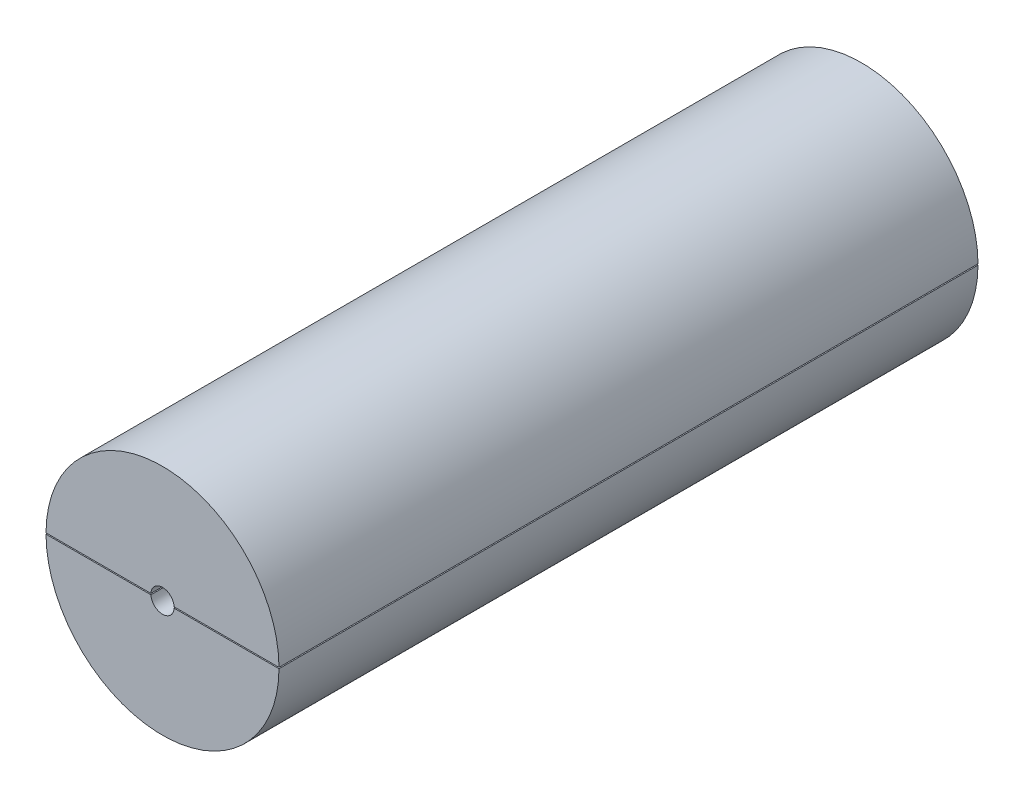
ISO-10303-21;
HEADER;
FILE_DESCRIPTION(('STEP AP214'),'2;1');
FILE_NAME('part.step','',(''),(''),'','','');
FILE_SCHEMA(('AUTOMOTIVE_DESIGN { 1 0 10303 214 1 1 1 1 }'));
ENDSEC;
DATA;
#1=APPLICATION_CONTEXT('core data for automotive mechanical design processes');
#2=APPLICATION_PROTOCOL_DEFINITION('international standard','automotive_design',2000,#1);
#3=PRODUCT_CONTEXT('',#1,'mechanical');
#4=PRODUCT('Part','Part','',(#3));
#5=PRODUCT_RELATED_PRODUCT_CATEGORY('part','',(#4));
#6=PRODUCT_DEFINITION_FORMATION('','',#4);
#7=PRODUCT_DEFINITION_CONTEXT('part definition',#1,'design');
#8=PRODUCT_DEFINITION('design','',#6,#7);
#9=PRODUCT_DEFINITION_SHAPE('','',#8);
#10=(LENGTH_UNIT() NAMED_UNIT(*) SI_UNIT(.MILLI.,.METRE.));
#11=(NAMED_UNIT(*) PLANE_ANGLE_UNIT() SI_UNIT($,.RADIAN.));
#12=(NAMED_UNIT(*) SI_UNIT($,.STERADIAN.) SOLID_ANGLE_UNIT());
#13=UNCERTAINTY_MEASURE_WITH_UNIT(LENGTH_MEASURE(1.E-05),#10,'distance_accuracy_value','');
#14=(GEOMETRIC_REPRESENTATION_CONTEXT(3) GLOBAL_UNCERTAINTY_ASSIGNED_CONTEXT((#13)) GLOBAL_UNIT_ASSIGNED_CONTEXT((#10,
#11,#12)) REPRESENTATION_CONTEXT('',''));
#15=CARTESIAN_POINT('',(0.,0.,0.));
#16=DIRECTION('',(0.,0.,1.));
#17=DIRECTION('',(1.,0.,0.));
#18=AXIS2_PLACEMENT_3D('',#15,#16,#17);
#19=CARTESIAN_POINT('',(0.,0.,-95.));
#20=DIRECTION('',(0.,0.,1.));
#21=DIRECTION('',(1.,0.,0.));
#22=AXIS2_PLACEMENT_3D('',#19,#20,#21);
#23=CYLINDRICAL_SURFACE('',#22,16.);
#24=CARTESIAN_POINT('',(15.9996874956982,0.100000200000962,-95.0002));
#25=CARTESIAN_POINT('',(15.9996876089245,0.0999613166636497,-94.9933909110656));
#26=CARTESIAN_POINT('',(15.9996833359999,0.100667343260459,-94.9866189886162));
#27=CARTESIAN_POINT('',(15.9996664742526,0.103322093203284,-94.9734331409172));
#28=CARTESIAN_POINT('',(15.9996540231289,0.105250221129936,-94.9670151631769));
#29=CARTESIAN_POINT('',(15.9996167256408,0.110786102343066,-94.9528734828148));
#30=CARTESIAN_POINT('',(15.9995894090706,0.11471028723087,-94.9452773244607));
#31=CARTESIAN_POINT('',(15.9995223957738,0.12370890358297,-94.9307562380063));
#32=CARTESIAN_POINT('',(15.999482612251,0.128791329006479,-94.9238364763829));
#33=CARTESIAN_POINT('',(15.9993504725112,0.144525673591268,-94.904808843254));
#34=CARTESIAN_POINT('',(15.9992426946636,0.1561363522168,-94.8935076802659));
#35=CARTESIAN_POINT('',(15.998984408498,0.180705288968248,-94.8725336488729));
#36=CARTESIAN_POINT('',(15.9988338081395,0.193666411233282,-94.8628643600561));
#37=CARTESIAN_POINT('',(15.9980346259693,0.255298625632148,-94.8205617079184));
#38=CARTESIAN_POINT('',(15.9971179787717,0.308242970572141,-94.7944084734029));
#39=CARTESIAN_POINT('',(15.9946762218346,0.416398657564381,-94.747491478125));
#40=CARTESIAN_POINT('',(15.9931468802502,0.471623319166156,-94.7267668945409));
#41=CARTESIAN_POINT('',(15.9876683633117,0.637564752046911,-94.6698337453855));
#42=CARTESIAN_POINT('',(15.982813728992,0.749883874807342,-94.6382317593188));
#43=CARTESIAN_POINT('',(15.9706204430243,0.975817455917367,-94.5805638647358));
#44=CARTESIAN_POINT('',(15.9632772031576,1.08943392957803,-94.5545083276732));
#45=CARTESIAN_POINT('',(15.946108566696,1.31703651192761,-94.5060300565223));
#46=CARTESIAN_POINT('',(15.9362882944059,1.43102138372045,-94.4835999776359));
#47=CARTESIAN_POINT('',(15.9141618109084,1.65909642172321,-94.441203693864));
#48=CARTESIAN_POINT('',(15.9018574595061,1.77318644596788,-94.421235663577));
#49=CARTESIAN_POINT('',(15.8386705583791,2.30505946467228,-94.3321411780839));
#50=CARTESIAN_POINT('',(15.7722764358871,2.72289413244487,-94.2736362565787));
#51=CARTESIAN_POINT('',(15.6061590460522,3.55355292641803,-94.1673325131355));
#52=CARTESIAN_POINT('',(15.5063990006465,3.9663710003421,-94.1195456028093));
#53=CARTESIAN_POINT('',(15.2738971238386,4.78425016336286,-94.0310629905377));
#54=CARTESIAN_POINT('',(15.1410951067343,5.18929562832988,-93.9903804618779));
#55=CARTESIAN_POINT('',(14.8434558371158,5.98776591234989,-93.9141900760265));
#56=CARTESIAN_POINT('',(14.6786295456577,6.3811946545708,-93.8786804555422));
#57=CARTESIAN_POINT('',(14.3183042194909,7.15312590557042,-93.8118329726691));
#58=CARTESIAN_POINT('',(14.122868793987,7.53165737562533,-93.7804867026022));
#59=CARTESIAN_POINT('',(13.7022902081215,8.27215629418123,-93.721208755686));
#60=CARTESIAN_POINT('',(13.4771448061774,8.63412249007385,-93.6932773367896));
#61=CARTESIAN_POINT('',(12.9987065689512,9.3388932284815,-93.6404131747481));
#62=CARTESIAN_POINT('',(12.7454290565378,9.68170805082223,-93.6154788144401));
#63=CARTESIAN_POINT('',(12.2122318728589,10.3461515685606,-93.568292528328));
#64=CARTESIAN_POINT('',(11.9323117119552,10.667779874409,-93.5460406518395));
#65=CARTESIAN_POINT('',(11.3317763928884,11.3045375699943,-93.5028700138265));
#66=CARTESIAN_POINT('',(11.0097789725468,11.6183742775231,-93.4820884778206));
#67=CARTESIAN_POINT('',(10.3404223446201,12.2179195559933,-93.443091603038));
#68=CARTESIAN_POINT('',(9.99306204875921,12.503626918718,-93.4248763744754));
#69=CARTESIAN_POINT('',(9.27536172801475,13.0449120839114,-93.3908787227275));
#70=CARTESIAN_POINT('',(8.90501607913624,13.300482467832,-93.3750968982585));
#71=CARTESIAN_POINT('',(8.14405853740691,13.7795665483632,-93.3458758669486));
#72=CARTESIAN_POINT('',(7.75344686456849,14.0030805928853,-93.3324366346828));
#73=CARTESIAN_POINT('',(6.95497153645159,14.4163217268977,-93.3078370478819));
#74=CARTESIAN_POINT('',(6.5471183822281,14.6060690255832,-93.2966753296779));
#75=CARTESIAN_POINT('',(5.71684009610057,14.9505769688768,-93.2765684201727));
#76=CARTESIAN_POINT('',(5.29441493339596,15.1053375395289,-93.267623233557));
#77=CARTESIAN_POINT('',(4.43801939847277,15.3787521135395,-93.2519118745392));
#78=CARTESIAN_POINT('',(4.00404957262244,15.4974078223197,-93.2451455992148));
#79=CARTESIAN_POINT('',(3.12763494114479,15.6977693048596,-93.2337649598654));
#80=CARTESIAN_POINT('',(2.68519014406141,15.7794751158678,-93.2291505936709));
#81=CARTESIAN_POINT('',(1.79528754715403,15.9053054539425,-93.2220591578145));
#82=CARTESIAN_POINT('',(1.34783347135442,15.949456235396,-93.2195805950155));
#83=CARTESIAN_POINT('',(0.450790584374749,15.9999561458381,-93.2167464468439));
#84=CARTESIAN_POINT('',(0.00120177397525275,16.0063052886476,-93.2163908606951));
#85=CARTESIAN_POINT('',(-0.896915468850043,15.9811562701698,-93.2178014243669));
#86=CARTESIAN_POINT('',(-1.34544389467319,15.9496578738371,-93.2195675873641));
#87=CARTESIAN_POINT('',(-2.23824728385251,15.8490395450346,-93.2252279223656));
#88=CARTESIAN_POINT('',(-2.68252224753776,15.7799196154753,-93.2291220942052));
#89=CARTESIAN_POINT('',(-3.56356082605615,15.6045741075047,-93.2390515384342));
#90=CARTESIAN_POINT('',(-4.0003260947656,15.4983568118579,-93.2450863328894));
#91=CARTESIAN_POINT('',(-4.86334332701998,15.2495758728171,-93.2593202877308));
#92=CARTESIAN_POINT('',(-5.28959529058503,15.1070122294925,-93.2675194481129));
#93=CARTESIAN_POINT('',(-6.12853978672644,14.7865688767694,-93.2861154409353));
#94=CARTESIAN_POINT('',(-6.54123291639549,14.608690724958,-93.2965121764503));
#95=CARTESIAN_POINT('',(-7.35014986045461,14.2188912851071,-93.3195503530631));
#96=CARTESIAN_POINT('',(-7.74637369200348,14.006970032537,-93.3321917918222));
#97=CARTESIAN_POINT('',(-8.51961263704004,13.5505641232963,-93.3597855869767));
#98=CARTESIAN_POINT('',(-8.89662425848611,13.3060735757599,-93.3747383615063));
#99=CARTESIAN_POINT('',(-9.62869175778507,12.7863135610525,-93.4070393256557));
#100=CARTESIAN_POINT('',(-9.98374751583813,12.5110439259616,-93.4243875283442));
#101=CARTESIAN_POINT('',(-10.6694792407113,11.9316282797633,-93.4616007689872));
#102=CARTESIAN_POINT('',(-11.0001487105794,11.6274746224466,-93.4814664738458));
#103=CARTESIAN_POINT('',(-11.6346591976653,10.9925490503296,-93.5238700275449));
#104=CARTESIAN_POINT('',(-11.9385007879715,10.6617777044161,-93.5464078192812));
#105=CARTESIAN_POINT('',(-12.5175748096972,9.97557596942283,-93.5944067247153));
#106=CARTESIAN_POINT('',(-12.7927717936654,9.62011591383932,-93.6198713803148));
#107=CARTESIAN_POINT('',(-13.3121916675464,8.88747395326126,-93.6740177660672));
#108=CARTESIAN_POINT('',(-13.5564145341072,8.5102920318905,-93.7026994986455));
#109=CARTESIAN_POINT('',(-14.0119527470274,7.73732704436563,-93.7637165519852));
#110=CARTESIAN_POINT('',(-14.2232996532385,7.34156229834177,-93.7960483167205));
#111=CARTESIAN_POINT('',(-14.6118286863923,6.53414934695187,-93.8650877076882));
#112=CARTESIAN_POINT('',(-14.7890230018084,6.12250687125296,-93.9017937652141));
#113=CARTESIAN_POINT('',(-15.1177607492653,5.26103448784112,-93.983159496293));
#114=CARTESIAN_POINT('',(-15.2671113616025,4.81039908055287,-94.0281654395767));
#115=CARTESIAN_POINT('',(-15.5248572014904,3.89905972148052,-94.1269000413085));
#116=CARTESIAN_POINT('',(-15.6333036882283,3.43836914181639,-94.1806176610893));
#117=CARTESIAN_POINT('',(-15.7813900769093,2.65577909383101,-94.2838014491195));
#118=CARTESIAN_POINT('',(-15.8319409012199,2.33540706536194,-94.329367974295));
#119=CARTESIAN_POINT('',(-15.9002382703701,1.79734487173969,-94.4162924843739));
#120=CARTESIAN_POINT('',(-15.9233064477128,1.57979492636594,-94.4542844166125));
#121=CARTESIAN_POINT('',(-15.9544067904815,1.21598143195715,-94.526649954306));
#122=CARTESIAN_POINT('',(-15.9648889140043,1.06939233534718,-94.5582276551417));
#123=CARTESIAN_POINT('',(-15.9790250330549,0.824957421528892,-94.618442989865));
#124=CARTESIAN_POINT('',(-15.9837908511062,0.726611608048616,-94.6447545962855));
#125=CARTESIAN_POINT('',(-15.9902319927996,0.562904755644311,-94.6950284405078));
#126=CARTESIAN_POINT('',(-15.9924081891383,0.497017516865857,-94.7170683716298));
#127=CARTESIAN_POINT('',(-15.9953597411122,0.387904962510545,-94.7594426264724));
#128=CARTESIAN_POINT('',(-15.9963603475854,0.344035447245782,-94.7781554322882));
#129=CARTESIAN_POINT('',(-15.9979512664039,0.259312220858589,-94.8201764183357));
#130=CARTESIAN_POINT('',(-15.9985504319209,0.218412502791065,-94.8433698180542));
#131=CARTESIAN_POINT('',(-15.9990578807033,0.173824630302468,-94.8783505669943));
#132=CARTESIAN_POINT('',(-15.9991394252677,0.166113741329733,-94.8848132898163));
#133=CARTESIAN_POINT('',(-15.9992862499205,0.151304439600525,-94.8984673443612));
#134=CARTESIAN_POINT('',(-15.9993514722893,0.144208256854711,-94.9056611387241));
#135=CARTESIAN_POINT('',(-15.9994661937343,0.130869905594723,-94.9210435021399));
#136=CARTESIAN_POINT('',(-15.9995153992775,0.124644757665149,-94.9292472105922));
#137=CARTESIAN_POINT('',(-15.999595721391,0.113866231631533,-94.946638258446));
#138=CARTESIAN_POINT('',(-15.9996270134528,0.109296801565154,-94.9558149732172));
#139=CARTESIAN_POINT('',(-15.9996617272515,0.104060878598926,-94.9709724047725));
#140=CARTESIAN_POINT('',(-15.9996713395364,0.102561035050069,-94.9766615397993));
#141=CARTESIAN_POINT('',(-15.9996843150547,0.10050957319414,-94.9882916988312));
#142=CARTESIAN_POINT('',(-15.9996875841723,0.0999722449097768,-94.9942351985383));
#143=CARTESIAN_POINT('',(-15.9996874956982,0.100000200000466,-95.0001999999998));
#144=B_SPLINE_CURVE_WITH_KNOTS('',3,(#24,#25,#26,#27,#28,#29,#30,#31,#32,#33,#34,#35,#36,#37,
#38,#39,#40,#41,#42,#43,#44,#45,#46,#47,#48,#49,#50,#51,#52,#53,#54,#55,#56,#57,#58,#59,#60,#61,
#62,#63,#64,#65,#66,#67,#68,#69,#70,#71,#72,#73,#74,#75,#76,#77,#78,#79,#80,#81,#82,#83,#84,#85,
#86,#87,#88,#89,#90,#91,#92,#93,#94,#95,#96,#97,#98,#99,#100,#101,#102,#103,#104,#105,#106,#107,
#108,#109,#110,#111,#112,#113,#114,#115,#116,#117,#118,#119,#120,#121,#122,#123,#124,#125,#126,
#127,#128,#129,#130,#131,#132,#133,#134,#135,#136,#137,#138,#139,#140,#141,#142,#143),
.UNSPECIFIED.,.F.,.F.,(4,2,2,2,2,2,2,2,2,2,2,2,2,2,2,2,2,2,2,2,2,2,2,2,2,2,2,2,2,2,2,2,2,2,2,2,
2,2,2,2,2,2,2,2,2,2,2,2,2,2,2,2,2,2,2,2,2,2,2,4),(0.,0.0203276874997605,0.0403215946535451,
0.065825125902997,0.0915103154199048,0.139848278536348,0.188290932517293,0.36412759133813,
0.541200279900517,0.890934143550809,1.24131634820838,1.59097956872924,1.94038196434234,
3.21978914217602,4.50061123809633,5.78378364410675,7.06651762563987,8.34662047222082,
9.62681995632306,10.906325535322,12.1858546335926,13.5345983833171,14.8834000392726,
16.2325330275021,17.581651372312,18.9299595422557,20.2782705622669,21.6265178845921,
22.9747638477702,24.322066487723,25.6693686350781,27.0166791496503,28.3639895599907,
29.7109993471412,31.0580091317129,32.4049595180578,33.7519085010272,35.0991014406618,
36.4463017304629,37.7938596520177,39.1413887805218,40.4905661201075,41.8397444768574,
43.1876195653679,44.5350127260693,45.9637046065986,47.390600119742,48.3724501280647,
49.0382740287623,49.4890061413488,49.7946381014166,50.0028950691584,50.1460340758411,
50.285902203099,50.3160520631035,50.3463070804724,50.3770888730386,50.4075637074367,
50.425137628634,50.4429703648064),.UNSPECIFIED.);
#145=CARTESIAN_POINT('',(15.9996874969482,0.1,-95.));
#146=VERTEX_POINT('',#145);
#147=CARTESIAN_POINT('',(-15.9996874969482,0.1,-95.));
#148=VERTEX_POINT('',#147);
#149=EDGE_CURVE('E109',#146,#148,#144,.T.);
#150=ORIENTED_EDGE('',*,*,#149,.F.);
#151=DIRECTION('',(0.,0.,1.));
#152=VECTOR('',#151,1.);
#153=CARTESIAN_POINT('',(15.9996874969482,0.1,-95.));
#154=LINE('',#153,#152);
#155=CARTESIAN_POINT('',(15.9996874969482,0.1,-5.));
#156=VERTEX_POINT('',#155);
#157=EDGE_CURVE('E122',#146,#156,#154,.T.);
#158=ORIENTED_EDGE('',*,*,#157,.T.);
#159=CARTESIAN_POINT('',(0.,0.,-5.));
#160=DIRECTION('',(0.,0.,1.));
#161=DIRECTION('',(1.,0.,0.));
#162=AXIS2_PLACEMENT_3D('',#159,#160,#161);
#163=CIRCLE('',#162,16.);
#164=CARTESIAN_POINT('',(-15.9996874969482,0.1,-5.));
#165=VERTEX_POINT('',#164);
#166=EDGE_CURVE('E114',#156,#165,#163,.T.);
#167=ORIENTED_EDGE('',*,*,#166,.T.);
#168=DIRECTION('',(0.,0.,1.));
#169=VECTOR('',#168,1.);
#170=CARTESIAN_POINT('',(-15.9996874969482,0.1,-95.));
#171=LINE('',#170,#169);
#172=EDGE_CURVE('E120',#165,#148,#171,.F.);
#173=ORIENTED_EDGE('',*,*,#172,.T.);
#174=EDGE_LOOP('',(#150,#158,#167,#173));
#175=FACE_BOUND('',#174,.T.);
#176=ADVANCED_FACE('F51',(#175),#23,.F.);
#177=CARTESIAN_POINT('',(0.,0.,-5.));
#178=DIRECTION('',(0.,0.,1.));
#179=DIRECTION('',(1.,0.,0.));
#180=AXIS2_PLACEMENT_3D('',#177,#178,#179);
#181=PLANE('',#180);
#182=DIRECTION('',(-1.,0.,0.));
#183=VECTOR('',#182,1.);
#184=CARTESIAN_POINT('',(0.,0.1,-5.));
#185=LINE('',#184,#183);
#186=CARTESIAN_POINT('',(1.99749843554382,0.1,-5.));
#187=VERTEX_POINT('',#186);
#188=EDGE_CURVE('E75',#156,#187,#185,.T.);
#189=ORIENTED_EDGE('',*,*,#188,.T.);
#190=CARTESIAN_POINT('',(0.,0.,-5.));
#191=DIRECTION('',(0.,0.,1.));
#192=DIRECTION('',(1.,0.,0.));
#193=AXIS2_PLACEMENT_3D('',#190,#191,#192);
#194=CIRCLE('',#193,2.);
#195=CARTESIAN_POINT('',(-1.99749843554382,0.1,-5.));
#196=VERTEX_POINT('',#195);
#197=EDGE_CURVE('E161',#187,#196,#194,.T.);
#198=ORIENTED_EDGE('',*,*,#197,.T.);
#199=EDGE_CURVE('E128',#196,#165,#185,.T.);
#200=ORIENTED_EDGE('',*,*,#199,.T.);
#201=ORIENTED_EDGE('',*,*,#166,.F.);
#202=EDGE_LOOP('',(#189,#198,#200,#201));
#203=FACE_BOUND('',#202,.T.);
#204=ADVANCED_FACE('F166',(#203),#181,.F.);
#205=CARTESIAN_POINT('',(-22.2825260642044,0.1,9.99999999999998));
#206=DIRECTION('',(0.,1.,0.));
#207=DIRECTION('',(0.,0.,1.));
#208=AXIS2_PLACEMENT_3D('',#205,#206,#207);
#209=PLANE('',#208);
#210=ORIENTED_EDGE('',*,*,#199,.F.);
#211=DIRECTION('',(0.,0.,1.));
#212=VECTOR('',#211,1.);
#213=CARTESIAN_POINT('',(-1.99749843554382,0.1,-10.));
#214=LINE('',#213,#212);
#215=CARTESIAN_POINT('',(-1.99749843554382,0.1,0.));
#216=VERTEX_POINT('',#215);
#217=EDGE_CURVE('E115',#196,#216,#214,.T.);
#218=ORIENTED_EDGE('',*,*,#217,.T.);
#219=DIRECTION('',(-1.,0.,0.));
#220=VECTOR('',#219,1.);
#221=CARTESIAN_POINT('',(0.,0.1,0.));
#222=LINE('',#221,#220);
#223=CARTESIAN_POINT('',(-19.9997499984375,0.1,0.));
#224=VERTEX_POINT('',#223);
#225=EDGE_CURVE('E108',#216,#224,#222,.T.);
#226=ORIENTED_EDGE('',*,*,#225,.T.);
#227=DIRECTION('',(0.,0.,1.));
#228=VECTOR('',#227,1.);
#229=CARTESIAN_POINT('',(-19.9997499984375,0.1,-120.));
#230=LINE('',#229,#228);
#231=CARTESIAN_POINT('',(-19.9997499984375,0.1,-120.));
#232=VERTEX_POINT('',#231);
#233=EDGE_CURVE('E91',#224,#232,#230,.F.);
#234=ORIENTED_EDGE('',*,*,#233,.T.);
#235=DIRECTION('',(1.,0.,0.));
#236=VECTOR('',#235,1.);
#237=CARTESIAN_POINT('',(-22.2825260642044,0.1,-120.));
#238=LINE('',#237,#236);
#239=CARTESIAN_POINT('',(19.9997499984375,0.1,-120.));
#240=VERTEX_POINT('',#239);
#241=EDGE_CURVE('E134',#232,#240,#238,.T.);
#242=ORIENTED_EDGE('',*,*,#241,.T.);
#243=DIRECTION('',(0.,0.,1.));
#244=VECTOR('',#243,1.);
#245=CARTESIAN_POINT('',(19.9997499984375,0.1,-120.));
#246=LINE('',#245,#244);
#247=CARTESIAN_POINT('',(19.9997499984375,0.1,0.));
#248=VERTEX_POINT('',#247);
#249=EDGE_CURVE('E137',#240,#248,#246,.T.);
#250=ORIENTED_EDGE('',*,*,#249,.T.);
#251=CARTESIAN_POINT('',(1.99749843554382,0.1,0.));
#252=VERTEX_POINT('',#251);
#253=EDGE_CURVE('E131',#248,#252,#222,.T.);
#254=ORIENTED_EDGE('',*,*,#253,.T.);
#255=DIRECTION('',(0.,0.,1.));
#256=VECTOR('',#255,1.);
#257=CARTESIAN_POINT('',(1.99749843554382,0.1,-10.));
#258=LINE('',#257,#256);
#259=EDGE_CURVE('E67',#252,#187,#258,.F.);
#260=ORIENTED_EDGE('',*,*,#259,.T.);
#261=ORIENTED_EDGE('',*,*,#188,.F.);
#262=ORIENTED_EDGE('',*,*,#157,.F.);
#263=CARTESIAN_POINT('',(0.,0.1,-95.));
#264=DIRECTION('',(0.,1.,0.));
#265=DIRECTION('',(0.,0.,1.));
#266=AXIS2_PLACEMENT_3D('',#263,#264,#265);
#267=CIRCLE('',#266,15.9996874969482);
#268=EDGE_CURVE('E12',#148,#146,#267,.F.);
#269=ORIENTED_EDGE('',*,*,#268,.F.);
#270=ORIENTED_EDGE('',*,*,#172,.F.);
#271=EDGE_LOOP('',(#210,#218,#226,#234,#242,#250,#254,#260,#261,#262,#269,#270));
#272=FACE_BOUND('',#271,.T.);
#273=ADVANCED_FACE('F119',(#272),#209,.F.);
#274=CARTESIAN_POINT('',(0.,0.,-120.));
#275=DIRECTION('',(0.,0.,1.));
#276=DIRECTION('',(1.,0.,0.));
#277=AXIS2_PLACEMENT_3D('',#274,#275,#276);
#278=CYLINDRICAL_SURFACE('',#277,20.);
#279=ORIENTED_EDGE('',*,*,#233,.F.);
#280=CARTESIAN_POINT('',(0.,0.,0.));
#281=DIRECTION('',(0.,0.,1.));
#282=DIRECTION('',(1.,0.,0.));
#283=AXIS2_PLACEMENT_3D('',#280,#281,#282);
#284=CIRCLE('',#283,20.);
#285=EDGE_CURVE('E60',#248,#224,#284,.T.);
#286=ORIENTED_EDGE('',*,*,#285,.F.);
#287=ORIENTED_EDGE('',*,*,#249,.F.);
#288=CARTESIAN_POINT('',(0.,0.,-120.));
#289=DIRECTION('',(0.,0.,1.));
#290=DIRECTION('',(1.,0.,0.));
#291=AXIS2_PLACEMENT_3D('',#288,#289,#290);
#292=CIRCLE('',#291,20.);
#293=EDGE_CURVE('E138',#240,#232,#292,.T.);
#294=ORIENTED_EDGE('',*,*,#293,.T.);
#295=EDGE_LOOP('',(#279,#286,#287,#294));
#296=FACE_BOUND('',#295,.T.);
#297=ADVANCED_FACE('F53',(#296),#278,.T.);
#298=CARTESIAN_POINT('',(0.,0.,-120.));
#299=DIRECTION('',(0.,0.,1.));
#300=DIRECTION('',(1.,0.,0.));
#301=AXIS2_PLACEMENT_3D('',#298,#299,#300);
#302=PLANE('',#301);
#303=ORIENTED_EDGE('',*,*,#293,.F.);
#304=ORIENTED_EDGE('',*,*,#241,.F.);
#305=EDGE_LOOP('',(#303,#304));
#306=FACE_BOUND('',#305,.T.);
#307=ADVANCED_FACE('F202',(#306),#302,.F.);
#308=CARTESIAN_POINT('',(0.,0.,0.));
#309=DIRECTION('',(0.,0.,1.));
#310=DIRECTION('',(1.,0.,0.));
#311=AXIS2_PLACEMENT_3D('',#308,#309,#310);
#312=PLANE('',#311);
#313=CARTESIAN_POINT('',(0.,0.,0.));
#314=DIRECTION('',(0.,0.,1.));
#315=DIRECTION('',(1.,0.,0.));
#316=AXIS2_PLACEMENT_3D('',#313,#314,#315);
#317=CIRCLE('',#316,2.);
#318=EDGE_CURVE('E162',#252,#216,#317,.T.);
#319=ORIENTED_EDGE('',*,*,#318,.F.);
#320=ORIENTED_EDGE('',*,*,#253,.F.);
#321=ORIENTED_EDGE('',*,*,#285,.T.);
#322=ORIENTED_EDGE('',*,*,#225,.F.);
#323=EDGE_LOOP('',(#319,#320,#321,#322));
#324=FACE_BOUND('',#323,.T.);
#325=ADVANCED_FACE('F147',(#324),#312,.T.);
#326=CARTESIAN_POINT('',(0.,0.1,-95.));
#327=DIRECTION('',(-1.,0.,0.));
#328=DIRECTION('',(0.,0.,1.));
#329=AXIS2_PLACEMENT_3D('',#326,#327,#328);
#330=SPHERICAL_SURFACE('',#329,15.9996874969482);
#331=ORIENTED_EDGE('',*,*,#149,.T.);
#332=ORIENTED_EDGE('',*,*,#268,.T.);
#333=EDGE_LOOP('',(#331,#332));
#334=FACE_BOUND('',#333,.T.);
#335=ADVANCED_FACE('F110',(#334),#330,.F.);
#336=CARTESIAN_POINT('',(0.,0.,-10.));
#337=DIRECTION('',(0.,0.,1.));
#338=DIRECTION('',(1.,0.,0.));
#339=AXIS2_PLACEMENT_3D('',#336,#337,#338);
#340=CYLINDRICAL_SURFACE('',#339,2.);
#341=ORIENTED_EDGE('',*,*,#197,.F.);
#342=ORIENTED_EDGE('',*,*,#259,.F.);
#343=ORIENTED_EDGE('',*,*,#318,.T.);
#344=ORIENTED_EDGE('',*,*,#217,.F.);
#345=EDGE_LOOP('',(#341,#342,#343,#344));
#346=FACE_BOUND('',#345,.T.);
#347=ADVANCED_FACE('F186',(#346),#340,.F.);
#348=CLOSED_SHELL('',(#176,#204,#273,#297,#307,#325,#335,#347));
#349=MANIFOLD_SOLID_BREP('B2',#348);
#350=CARTESIAN_POINT('',(0.,0.,-95.));
#351=DIRECTION('',(0.,0.,1.));
#352=DIRECTION('',(1.,0.,0.));
#353=AXIS2_PLACEMENT_3D('',#350,#351,#352);
#354=CYLINDRICAL_SURFACE('',#353,16.);
#355=CARTESIAN_POINT('',(-15.9996874956982,-0.100000200000962,-95.0002));
#356=CARTESIAN_POINT('',(-15.9996876089245,-0.0999613166636497,-94.9933909110656));
#357=CARTESIAN_POINT('',(-15.9996833359999,-0.100667343260459,-94.9866189886162));
#358=CARTESIAN_POINT('',(-15.9996664742526,-0.103322093203284,-94.9734331409172));
#359=CARTESIAN_POINT('',(-15.9996540231289,-0.105250221129936,-94.9670151631769));
#360=CARTESIAN_POINT('',(-15.9996167256408,-0.110786102343066,-94.9528734828148));
#361=CARTESIAN_POINT('',(-15.9995894090706,-0.11471028723087,-94.9452773244607));
#362=CARTESIAN_POINT('',(-15.9995223957738,-0.12370890358297,-94.9307562380063));
#363=CARTESIAN_POINT('',(-15.999482612251,-0.128791329006479,-94.9238364763829));
#364=CARTESIAN_POINT('',(-15.9993504725112,-0.144525673591268,-94.904808843254));
#365=CARTESIAN_POINT('',(-15.9992426946636,-0.1561363522168,-94.8935076802659));
#366=CARTESIAN_POINT('',(-15.998984408498,-0.180705288968248,-94.8725336488729));
#367=CARTESIAN_POINT('',(-15.9988338081395,-0.193666411233282,-94.8628643600561));
#368=CARTESIAN_POINT('',(-15.9980346259693,-0.255298625632148,-94.8205617079184));
#369=CARTESIAN_POINT('',(-15.9971179787717,-0.308242970572142,-94.7944084734029));
#370=CARTESIAN_POINT('',(-15.9946762218346,-0.416398657564381,-94.747491478125));
#371=CARTESIAN_POINT('',(-15.9931468802502,-0.471623319166156,-94.7267668945409));
#372=CARTESIAN_POINT('',(-15.9876683633117,-0.637564752046911,-94.6698337453855));
#373=CARTESIAN_POINT('',(-15.982813728992,-0.749883874807342,-94.6382317593188));
#374=CARTESIAN_POINT('',(-15.9706204430243,-0.975817455917369,-94.5805638647358));
#375=CARTESIAN_POINT('',(-15.9632772031576,-1.08943392957804,-94.5545083276732));
#376=CARTESIAN_POINT('',(-15.946108566696,-1.31703651192761,-94.5060300565223));
#377=CARTESIAN_POINT('',(-15.9362882944059,-1.43102138372045,-94.4835999776359));
#378=CARTESIAN_POINT('',(-15.9141618109084,-1.65909642172321,-94.441203693864));
#379=CARTESIAN_POINT('',(-15.9018574595061,-1.77318644596788,-94.421235663577));
#380=CARTESIAN_POINT('',(-15.8386705583791,-2.30505946467229,-94.3321411780839));
#381=CARTESIAN_POINT('',(-15.7722764358871,-2.72289413244486,-94.2736362565786));
#382=CARTESIAN_POINT('',(-15.6061590460522,-3.55355292641803,-94.1673325131355));
#383=CARTESIAN_POINT('',(-15.5063990006465,-3.96637100034211,-94.1195456028093));
#384=CARTESIAN_POINT('',(-15.2738971238386,-4.78425016336287,-94.0310629905378));
#385=CARTESIAN_POINT('',(-15.1410951067343,-5.18929562832988,-93.9903804618779));
#386=CARTESIAN_POINT('',(-14.8434558371158,-5.98776591234989,-93.9141900760265));
#387=CARTESIAN_POINT('',(-14.6786295456577,-6.3811946545708,-93.8786804555422));
#388=CARTESIAN_POINT('',(-14.3183042194909,-7.15312590557042,-93.8118329726691));
#389=CARTESIAN_POINT('',(-14.122868793987,-7.53165737562534,-93.7804867026023));
#390=CARTESIAN_POINT('',(-13.7022902081215,-8.27215629418123,-93.721208755686));
#391=CARTESIAN_POINT('',(-13.4771448061774,-8.63412249007385,-93.6932773367896));
#392=CARTESIAN_POINT('',(-12.9987065689512,-9.3388932284815,-93.640413174748));
#393=CARTESIAN_POINT('',(-12.7454290565378,-9.68170805082223,-93.6154788144401));
#394=CARTESIAN_POINT('',(-12.2122318728589,-10.3461515685606,-93.568292528328));
#395=CARTESIAN_POINT('',(-11.9323117119552,-10.667779874409,-93.5460406518395));
#396=CARTESIAN_POINT('',(-11.3317763928884,-11.3045375699943,-93.5028700138265));
#397=CARTESIAN_POINT('',(-11.0097789725468,-11.6183742775232,-93.4820884778206));
#398=CARTESIAN_POINT('',(-10.3404223446201,-12.2179195559933,-93.4430916030381));
#399=CARTESIAN_POINT('',(-9.9930620487592,-12.503626918718,-93.4248763744755));
#400=CARTESIAN_POINT('',(-9.27536172801475,-13.0449120839114,-93.3908787227276));
#401=CARTESIAN_POINT('',(-8.90501607913623,-13.300482467832,-93.3750968982586));
#402=CARTESIAN_POINT('',(-8.1440585374069,-13.7795665483632,-93.3458758669486));
#403=CARTESIAN_POINT('',(-7.75344686456848,-14.0030805928853,-93.3324366346828));
#404=CARTESIAN_POINT('',(-6.95497153645158,-14.4163217268977,-93.307837047882));
#405=CARTESIAN_POINT('',(-6.54711838222809,-14.6060690255832,-93.2966753296779));
#406=CARTESIAN_POINT('',(-5.71684009610056,-14.9505769688769,-93.2765684201727));
#407=CARTESIAN_POINT('',(-5.29441493339595,-15.105337539529,-93.267623233557));
#408=CARTESIAN_POINT('',(-4.43801939847277,-15.3787521135395,-93.2519118745392));
#409=CARTESIAN_POINT('',(-4.00404957262243,-15.4974078223197,-93.2451455992148));
#410=CARTESIAN_POINT('',(-3.12763494114478,-15.6977693048596,-93.2337649598654));
#411=CARTESIAN_POINT('',(-2.68519014406141,-15.7794751158678,-93.2291505936709));
#412=CARTESIAN_POINT('',(-1.79528754715403,-15.9053054539425,-93.2220591578145));
#413=CARTESIAN_POINT('',(-1.34783347135441,-15.949456235396,-93.2195805950154));
#414=CARTESIAN_POINT('',(-0.450790584374741,-15.9999561458381,-93.2167464468439));
#415=CARTESIAN_POINT('',(-0.0012017739752438,-16.0063052886476,-93.2163908606951));
#416=CARTESIAN_POINT('',(0.896915468850053,-15.9811562701698,-93.2178014243669));
#417=CARTESIAN_POINT('',(1.34544389467319,-15.9496578738371,-93.2195675873641));
#418=CARTESIAN_POINT('',(2.23824728385252,-15.8490395450346,-93.2252279223656));
#419=CARTESIAN_POINT('',(2.68252224753777,-15.7799196154753,-93.2291220942052));
#420=CARTESIAN_POINT('',(3.56356082605616,-15.6045741075047,-93.2390515384341));
#421=CARTESIAN_POINT('',(4.00032609476561,-15.4983568118579,-93.2450863328893));
#422=CARTESIAN_POINT('',(4.86334332701999,-15.2495758728171,-93.2593202877308));
#423=CARTESIAN_POINT('',(5.28959529058504,-15.1070122294925,-93.2675194481129));
#424=CARTESIAN_POINT('',(6.12853978672645,-14.7865688767694,-93.2861154409353));
#425=CARTESIAN_POINT('',(6.54123291639549,-14.608690724958,-93.2965121764504));
#426=CARTESIAN_POINT('',(7.35014986045462,-14.2188912851071,-93.3195503530632));
#427=CARTESIAN_POINT('',(7.74637369200349,-14.006970032537,-93.3321917918222));
#428=CARTESIAN_POINT('',(8.51961263704005,-13.5505641232963,-93.3597855869767));
#429=CARTESIAN_POINT('',(8.89662425848612,-13.3060735757599,-93.3747383615063));
#430=CARTESIAN_POINT('',(9.62869175778508,-12.7863135610525,-93.4070393256556));
#431=CARTESIAN_POINT('',(9.98374751583814,-12.5110439259616,-93.4243875283441));
#432=CARTESIAN_POINT('',(10.6694792407113,-11.9316282797633,-93.4616007689872));
#433=CARTESIAN_POINT('',(11.0001487105794,-11.6274746224466,-93.4814664738457));
#434=CARTESIAN_POINT('',(11.6346591976653,-10.9925490503296,-93.5238700275449));
#435=CARTESIAN_POINT('',(11.9385007879715,-10.6617777044161,-93.5464078192812));
#436=CARTESIAN_POINT('',(12.5175748096972,-9.97557596942282,-93.5944067247153));
#437=CARTESIAN_POINT('',(12.7927717936654,-9.62011591383931,-93.6198713803148));
#438=CARTESIAN_POINT('',(13.3121916675464,-8.88747395326126,-93.6740177660673));
#439=CARTESIAN_POINT('',(13.5564145341072,-8.5102920318905,-93.7026994986455));
#440=CARTESIAN_POINT('',(14.0119527470274,-7.73732704436563,-93.7637165519852));
#441=CARTESIAN_POINT('',(14.2232996532385,-7.34156229834176,-93.7960483167205));
#442=CARTESIAN_POINT('',(14.6118286863923,-6.53414934695186,-93.8650877076882));
#443=CARTESIAN_POINT('',(14.7890230018084,-6.12250687125296,-93.9017937652141));
#444=CARTESIAN_POINT('',(15.1177607492653,-5.26103448784112,-93.983159496293));
#445=CARTESIAN_POINT('',(15.2671113616025,-4.81039908055286,-94.0281654395767));
#446=CARTESIAN_POINT('',(15.5248572014904,-3.89905972148051,-94.1269000413084));
#447=CARTESIAN_POINT('',(15.6333036882283,-3.43836914181638,-94.1806176610893));
#448=CARTESIAN_POINT('',(15.7813900769093,-2.65577909383101,-94.2838014491195));
#449=CARTESIAN_POINT('',(15.8319409012199,-2.33540706536195,-94.3293679742951));
#450=CARTESIAN_POINT('',(15.9002382703701,-1.79734487173966,-94.4162924843739));
#451=CARTESIAN_POINT('',(15.9233064477128,-1.57979492636587,-94.4542844166124));
#452=CARTESIAN_POINT('',(15.9544067904815,-1.21598143195714,-94.5266499543061));
#453=CARTESIAN_POINT('',(15.9648889140043,-1.06939233534725,-94.5582276551419));
#454=CARTESIAN_POINT('',(15.9790250330548,-0.824957421529264,-94.6184429898649));
#455=CARTESIAN_POINT('',(15.9837908511061,-0.726611608049261,-94.6447545962852));
#456=CARTESIAN_POINT('',(15.9902319927996,-0.56290475564553,-94.6950284405074));
#457=CARTESIAN_POINT('',(15.9924081891382,-0.497017516867337,-94.7170683716294));
#458=CARTESIAN_POINT('',(15.9953597411122,-0.387904962512207,-94.7594426264719));
#459=CARTESIAN_POINT('',(15.9963603475853,-0.344035447247405,-94.7781554322876));
#460=CARTESIAN_POINT('',(15.9979512664038,-0.259312220860425,-94.8201764183346));
#461=CARTESIAN_POINT('',(15.9985504319208,-0.218412502793137,-94.8433698180527));
#462=CARTESIAN_POINT('',(15.9990578807033,-0.173824630304639,-94.8783505669924));
#463=CARTESIAN_POINT('',(15.9991394252677,-0.166113741331788,-94.8848132898146));
#464=CARTESIAN_POINT('',(15.9992862499205,-0.151304439602436,-94.8984673443596));
#465=CARTESIAN_POINT('',(15.9993514722893,-0.144208256856597,-94.9056611387227));
#466=CARTESIAN_POINT('',(15.9994661937343,-0.130869905596068,-94.9210435021384));
#467=CARTESIAN_POINT('',(15.9995153992774,-0.12464475766597,-94.9292472105905));
#468=CARTESIAN_POINT('',(15.999595721391,-0.113866231632152,-94.9466382584446));
#469=CARTESIAN_POINT('',(15.9996270134528,-0.109296801566087,-94.955814973216));
#470=CARTESIAN_POINT('',(15.9996617272515,-0.104060878599361,-94.9709724047716));
#471=CARTESIAN_POINT('',(15.9996713395364,-0.102561035050114,-94.9766615397986));
#472=CARTESIAN_POINT('',(15.9996843150547,-0.100509573193847,-94.9882916988308));
#473=CARTESIAN_POINT('',(15.9996875841723,-0.0999722449095448,-94.9942351985381));
#474=CARTESIAN_POINT('',(15.9996874956982,-0.100000200000947,-95.0002));
#475=B_SPLINE_CURVE_WITH_KNOTS('',3,(#355,#356,#357,#358,#359,#360,#361,#362,#363,#364,#365,
#366,#367,#368,#369,#370,#371,#372,#373,#374,#375,#376,#377,#378,#379,#380,#381,#382,#383,#384,
#385,#386,#387,#388,#389,#390,#391,#392,#393,#394,#395,#396,#397,#398,#399,#400,#401,#402,#403,
#404,#405,#406,#407,#408,#409,#410,#411,#412,#413,#414,#415,#416,#417,#418,#419,#420,#421,#422,
#423,#424,#425,#426,#427,#428,#429,#430,#431,#432,#433,#434,#435,#436,#437,#438,#439,#440,#441,
#442,#443,#444,#445,#446,#447,#448,#449,#450,#451,#452,#453,#454,#455,#456,#457,#458,#459,#460,
#461,#462,#463,#464,#465,#466,#467,#468,#469,#470,#471,#472,#473,#474),.UNSPECIFIED.,.F.,.F.,(4,
2,2,2,2,2,2,2,2,2,2,2,2,2,2,2,2,2,2,2,2,2,2,2,2,2,2,2,2,2,2,2,2,2,2,2,2,2,2,2,2,2,2,2,2,2,2,2,2,
2,2,2,2,2,2,2,2,2,2,4),(0.,0.0203276874997605,0.0403215946535451,0.065825125902997,
0.0915103154199048,0.139848278536348,0.188290932517293,0.36412759133813,0.541200279900517,
0.890934143550806,1.24131634820838,1.59097956872925,1.94038196434234,3.21978914217602,
4.50061123809634,5.78378364410675,7.06651762563987,8.34662047222082,9.62681995632306,
10.906325535322,12.1858546335926,13.5345983833171,14.8834000392726,16.2325330275021,
17.581651372312,18.9299595422557,20.2782705622669,21.6265178845921,22.9747638477702,
24.322066487723,25.6693686350781,27.0166791496503,28.3639895599907,29.7109993471413,
31.0580091317129,32.4049595180578,33.7519085010273,35.0991014406618,36.4463017304629,
37.7938596520177,39.1413887805218,40.4905661201075,41.8397444768574,43.1876195653679,
44.5350127260693,45.9637046065986,47.390600119742,48.3724501280647,49.0382740287624,
49.4890061413488,49.7946381014155,50.0028950691566,50.1460340758393,50.285902203096,
50.3160520631009,50.3463070804702,50.3770888730369,50.4075637074354,50.4251376286334,
50.4429703648065),.UNSPECIFIED.);
#476=CARTESIAN_POINT('',(-15.9996874969482,-0.1,-95.));
#477=VERTEX_POINT('',#476);
#478=CARTESIAN_POINT('',(15.9996874969482,-0.1,-95.));
#479=VERTEX_POINT('',#478);
#480=EDGE_CURVE('E313',#477,#479,#475,.T.);
#481=ORIENTED_EDGE('',*,*,#480,.F.);
#482=DIRECTION('',(0.,0.,1.));
#483=VECTOR('',#482,1.);
#484=CARTESIAN_POINT('',(-15.9996874969482,-0.1,-95.));
#485=LINE('',#484,#483);
#486=CARTESIAN_POINT('',(-15.9996874969482,-0.1,-5.));
#487=VERTEX_POINT('',#486);
#488=EDGE_CURVE('E324',#477,#487,#485,.T.);
#489=ORIENTED_EDGE('',*,*,#488,.T.);
#490=CARTESIAN_POINT('',(0.,0.,-5.));
#491=DIRECTION('',(0.,0.,1.));
#492=DIRECTION('',(1.,0.,0.));
#493=AXIS2_PLACEMENT_3D('',#490,#491,#492);
#494=CIRCLE('',#493,16.);
#495=CARTESIAN_POINT('',(15.9996874969482,-0.1,-5.));
#496=VERTEX_POINT('',#495);
#497=EDGE_CURVE('E331',#487,#496,#494,.T.);
#498=ORIENTED_EDGE('',*,*,#497,.T.);
#499=DIRECTION('',(0.,0.,1.));
#500=VECTOR('',#499,1.);
#501=CARTESIAN_POINT('',(15.9996874969482,-0.1,-95.));
#502=LINE('',#501,#500);
#503=EDGE_CURVE('E321',#496,#479,#502,.F.);
#504=ORIENTED_EDGE('',*,*,#503,.T.);
#505=EDGE_LOOP('',(#481,#489,#498,#504));
#506=FACE_BOUND('',#505,.T.);
#507=ADVANCED_FACE('F249',(#506),#354,.F.);
#508=CARTESIAN_POINT('',(0.,0.,-5.));
#509=DIRECTION('',(0.,0.,1.));
#510=DIRECTION('',(1.,0.,0.));
#511=AXIS2_PLACEMENT_3D('',#508,#509,#510);
#512=PLANE('',#511);
#513=DIRECTION('',(1.,0.,0.));
#514=VECTOR('',#513,1.);
#515=CARTESIAN_POINT('',(0.,-0.1,-5.));
#516=LINE('',#515,#514);
#517=CARTESIAN_POINT('',(-1.99749843554382,-0.1,-5.));
#518=VERTEX_POINT('',#517);
#519=EDGE_CURVE('E257',#487,#518,#516,.T.);
#520=ORIENTED_EDGE('',*,*,#519,.T.);
#521=CARTESIAN_POINT('',(0.,0.,-5.));
#522=DIRECTION('',(0.,0.,1.));
#523=DIRECTION('',(1.,0.,0.));
#524=AXIS2_PLACEMENT_3D('',#521,#522,#523);
#525=CIRCLE('',#524,2.);
#526=CARTESIAN_POINT('',(1.99749843554382,-0.1,-5.));
#527=VERTEX_POINT('',#526);
#528=EDGE_CURVE('E314',#518,#527,#525,.T.);
#529=ORIENTED_EDGE('',*,*,#528,.T.);
#530=EDGE_CURVE('E312',#527,#496,#516,.T.);
#531=ORIENTED_EDGE('',*,*,#530,.T.);
#532=ORIENTED_EDGE('',*,*,#497,.F.);
#533=EDGE_LOOP('',(#520,#529,#531,#532));
#534=FACE_BOUND('',#533,.T.);
#535=ADVANCED_FACE('F340',(#534),#512,.F.);
#536=CARTESIAN_POINT('',(21.4278855915733,-0.1,9.99999999999998));
#537=DIRECTION('',(0.,-1.,0.));
#538=DIRECTION('',(0.,0.,-1.));
#539=AXIS2_PLACEMENT_3D('',#536,#537,#538);
#540=PLANE('',#539);
#541=ORIENTED_EDGE('',*,*,#530,.F.);
#542=DIRECTION('',(0.,0.,1.));
#543=VECTOR('',#542,1.);
#544=CARTESIAN_POINT('',(1.99749843554382,-0.1,-10.));
#545=LINE('',#544,#543);
#546=CARTESIAN_POINT('',(1.99749843554382,-0.1,0.));
#547=VERTEX_POINT('',#546);
#548=EDGE_CURVE('E302',#527,#547,#545,.T.);
#549=ORIENTED_EDGE('',*,*,#548,.T.);
#550=DIRECTION('',(1.,0.,0.));
#551=VECTOR('',#550,1.);
#552=CARTESIAN_POINT('',(0.,-0.1,0.));
#553=LINE('',#552,#551);
#554=CARTESIAN_POINT('',(19.9997499984375,-0.1,0.));
#555=VERTEX_POINT('',#554);
#556=EDGE_CURVE('E309',#547,#555,#553,.T.);
#557=ORIENTED_EDGE('',*,*,#556,.T.);
#558=DIRECTION('',(0.,0.,1.));
#559=VECTOR('',#558,1.);
#560=CARTESIAN_POINT('',(19.9997499984375,-0.1,-120.));
#561=LINE('',#560,#559);
#562=CARTESIAN_POINT('',(19.9997499984375,-0.1,-120.));
#563=VERTEX_POINT('',#562);
#564=EDGE_CURVE('E329',#555,#563,#561,.F.);
#565=ORIENTED_EDGE('',*,*,#564,.T.);
#566=DIRECTION('',(-1.,0.,0.));
#567=VECTOR('',#566,1.);
#568=CARTESIAN_POINT('',(21.4278855915733,-0.1,-120.));
#569=LINE('',#568,#567);
#570=CARTESIAN_POINT('',(-19.9997499984375,-0.1,-120.));
#571=VERTEX_POINT('',#570);
#572=EDGE_CURVE('E346',#563,#571,#569,.T.);
#573=ORIENTED_EDGE('',*,*,#572,.T.);
#574=DIRECTION('',(0.,0.,1.));
#575=VECTOR('',#574,1.);
#576=CARTESIAN_POINT('',(-19.9997499984375,-0.1,-120.));
#577=LINE('',#576,#575);
#578=CARTESIAN_POINT('',(-19.9997499984375,-0.1,0.));
#579=VERTEX_POINT('',#578);
#580=EDGE_CURVE('E272',#571,#579,#577,.T.);
#581=ORIENTED_EDGE('',*,*,#580,.T.);
#582=CARTESIAN_POINT('',(-1.99749843554382,-0.1,0.));
#583=VERTEX_POINT('',#582);
#584=EDGE_CURVE('E320',#579,#583,#553,.T.);
#585=ORIENTED_EDGE('',*,*,#584,.T.);
#586=DIRECTION('',(0.,0.,1.));
#587=VECTOR('',#586,1.);
#588=CARTESIAN_POINT('',(-1.99749843554382,-0.1,-10.));
#589=LINE('',#588,#587);
#590=EDGE_CURVE('E264',#583,#518,#589,.F.);
#591=ORIENTED_EDGE('',*,*,#590,.T.);
#592=ORIENTED_EDGE('',*,*,#519,.F.);
#593=ORIENTED_EDGE('',*,*,#488,.F.);
#594=CARTESIAN_POINT('',(0.,-0.1,-95.));
#595=DIRECTION('',(0.,-1.,0.));
#596=DIRECTION('',(0.,0.,-1.));
#597=AXIS2_PLACEMENT_3D('',#594,#595,#596);
#598=CIRCLE('',#597,15.9996874969482);
#599=EDGE_CURVE('E49',#479,#477,#598,.F.);
#600=ORIENTED_EDGE('',*,*,#599,.F.);
#601=ORIENTED_EDGE('',*,*,#503,.F.);
#602=EDGE_LOOP('',(#541,#549,#557,#565,#573,#581,#585,#591,#592,#593,#600,#601));
#603=FACE_BOUND('',#602,.T.);
#604=ADVANCED_FACE('F308',(#603),#540,.F.);
#605=CARTESIAN_POINT('',(0.,0.,-120.));
#606=DIRECTION('',(0.,0.,1.));
#607=DIRECTION('',(1.,0.,0.));
#608=AXIS2_PLACEMENT_3D('',#605,#606,#607);
#609=PLANE('',#608);
#610=CARTESIAN_POINT('',(0.,0.,-120.));
#611=DIRECTION('',(0.,0.,1.));
#612=DIRECTION('',(1.,0.,0.));
#613=AXIS2_PLACEMENT_3D('',#610,#611,#612);
#614=CIRCLE('',#613,20.);
#615=EDGE_CURVE('E334',#571,#563,#614,.T.);
#616=ORIENTED_EDGE('',*,*,#615,.F.);
#617=ORIENTED_EDGE('',*,*,#572,.F.);
#618=EDGE_LOOP('',(#616,#617));
#619=FACE_BOUND('',#618,.T.);
#620=ADVANCED_FACE('F366',(#619),#609,.F.);
#621=CARTESIAN_POINT('',(0.,0.,0.));
#622=DIRECTION('',(0.,0.,1.));
#623=DIRECTION('',(1.,0.,0.));
#624=AXIS2_PLACEMENT_3D('',#621,#622,#623);
#625=PLANE('',#624);
#626=CARTESIAN_POINT('',(0.,0.,0.));
#627=DIRECTION('',(0.,0.,1.));
#628=DIRECTION('',(1.,0.,0.));
#629=AXIS2_PLACEMENT_3D('',#626,#627,#628);
#630=CIRCLE('',#629,2.);
#631=EDGE_CURVE('E299',#583,#547,#630,.T.);
#632=ORIENTED_EDGE('',*,*,#631,.F.);
#633=ORIENTED_EDGE('',*,*,#584,.F.);
#634=CARTESIAN_POINT('',(0.,0.,0.));
#635=DIRECTION('',(0.,0.,1.));
#636=DIRECTION('',(1.,0.,0.));
#637=AXIS2_PLACEMENT_3D('',#634,#635,#636);
#638=CIRCLE('',#637,20.);
#639=EDGE_CURVE('E319',#579,#555,#638,.T.);
#640=ORIENTED_EDGE('',*,*,#639,.T.);
#641=ORIENTED_EDGE('',*,*,#556,.F.);
#642=EDGE_LOOP('',(#632,#633,#640,#641));
#643=FACE_BOUND('',#642,.T.);
#644=ADVANCED_FACE('F317',(#643),#625,.T.);
#645=CARTESIAN_POINT('',(0.,0.,-120.));
#646=DIRECTION('',(0.,0.,1.));
#647=DIRECTION('',(1.,0.,0.));
#648=AXIS2_PLACEMENT_3D('',#645,#646,#647);
#649=CYLINDRICAL_SURFACE('',#648,20.);
#650=ORIENTED_EDGE('',*,*,#564,.F.);
#651=ORIENTED_EDGE('',*,*,#639,.F.);
#652=ORIENTED_EDGE('',*,*,#580,.F.);
#653=ORIENTED_EDGE('',*,*,#615,.T.);
#654=EDGE_LOOP('',(#650,#651,#652,#653));
#655=FACE_BOUND('',#654,.T.);
#656=ADVANCED_FACE('F251',(#655),#649,.T.);
#657=CARTESIAN_POINT('',(0.,-0.1,-95.));
#658=DIRECTION('',(-1.,0.,0.));
#659=DIRECTION('',(0.,0.,-1.));
#660=AXIS2_PLACEMENT_3D('',#657,#658,#659);
#661=SPHERICAL_SURFACE('',#660,15.9996874969482);
#662=ORIENTED_EDGE('',*,*,#480,.T.);
#663=ORIENTED_EDGE('',*,*,#599,.T.);
#664=EDGE_LOOP('',(#662,#663));
#665=FACE_BOUND('',#664,.T.);
#666=ADVANCED_FACE('F359',(#665),#661,.F.);
#667=CARTESIAN_POINT('',(0.,0.,-10.));
#668=DIRECTION('',(0.,0.,1.));
#669=DIRECTION('',(1.,0.,0.));
#670=AXIS2_PLACEMENT_3D('',#667,#668,#669);
#671=CYLINDRICAL_SURFACE('',#670,2.);
#672=ORIENTED_EDGE('',*,*,#528,.F.);
#673=ORIENTED_EDGE('',*,*,#590,.F.);
#674=ORIENTED_EDGE('',*,*,#631,.T.);
#675=ORIENTED_EDGE('',*,*,#548,.F.);
#676=EDGE_LOOP('',(#672,#673,#674,#675));
#677=FACE_BOUND('',#676,.T.);
#678=ADVANCED_FACE('F301',(#677),#671,.F.);
#679=CLOSED_SHELL('',(#507,#535,#604,#620,#644,#656,#666,#678));
#680=MANIFOLD_SOLID_BREP('B6',#679);
#681=ADVANCED_BREP_SHAPE_REPRESENTATION('',(#18,#349,#680),#14);
#682=SHAPE_DEFINITION_REPRESENTATION(#9,#681);
ENDSEC;
END-ISO-10303-21;
